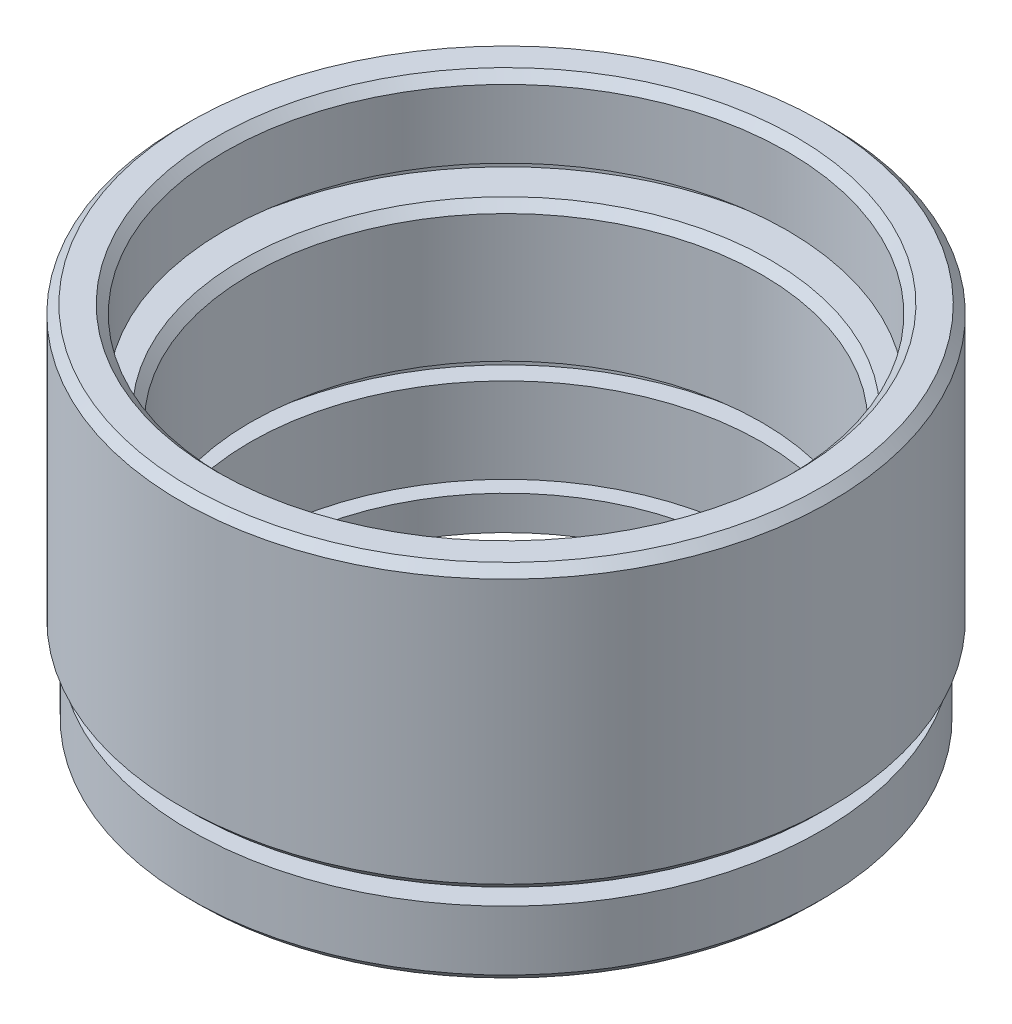
ISO-10303-21;
HEADER;
FILE_DESCRIPTION(('STEP AP214'),'2;1');
FILE_NAME('part.step','',(''),(''),'','','');
FILE_SCHEMA(('AUTOMOTIVE_DESIGN { 1 0 10303 214 1 1 1 1 }'));
ENDSEC;
DATA;
#1=APPLICATION_CONTEXT('core data for automotive mechanical design processes');
#2=APPLICATION_PROTOCOL_DEFINITION('international standard','automotive_design',2000,#1);
#3=PRODUCT_CONTEXT('',#1,'mechanical');
#4=PRODUCT('Part','Part','',(#3));
#5=PRODUCT_RELATED_PRODUCT_CATEGORY('part','',(#4));
#6=PRODUCT_DEFINITION_FORMATION('','',#4);
#7=PRODUCT_DEFINITION_CONTEXT('part definition',#1,'design');
#8=PRODUCT_DEFINITION('design','',#6,#7);
#9=PRODUCT_DEFINITION_SHAPE('','',#8);
#10=(LENGTH_UNIT() NAMED_UNIT(*) SI_UNIT(.MILLI.,.METRE.));
#11=(NAMED_UNIT(*) PLANE_ANGLE_UNIT() SI_UNIT($,.RADIAN.));
#12=(NAMED_UNIT(*) SI_UNIT($,.STERADIAN.) SOLID_ANGLE_UNIT());
#13=UNCERTAINTY_MEASURE_WITH_UNIT(LENGTH_MEASURE(1.E-05),#10,'distance_accuracy_value','');
#14=(GEOMETRIC_REPRESENTATION_CONTEXT(3) GLOBAL_UNCERTAINTY_ASSIGNED_CONTEXT((#13)) GLOBAL_UNIT_ASSIGNED_CONTEXT((#10,
#11,#12)) REPRESENTATION_CONTEXT('',''));
#15=CARTESIAN_POINT('',(0.,0.,0.));
#16=DIRECTION('',(0.,0.,1.));
#17=DIRECTION('',(1.,0.,0.));
#18=AXIS2_PLACEMENT_3D('',#15,#16,#17);
#19=CARTESIAN_POINT('',(16.5,21.5,0.));
#20=DIRECTION('',(0.,1.,0.));
#21=DIRECTION('',(0.,0.,1.));
#22=AXIS2_PLACEMENT_3D('',#19,#20,#21);
#23=PLANE('',#22);
#24=CARTESIAN_POINT('',(0.,21.5,0.));
#25=DIRECTION('',(0.,1.,0.));
#26=DIRECTION('',(0.,0.,1.));
#27=AXIS2_PLACEMENT_3D('',#24,#25,#26);
#28=CIRCLE('',#27,17.);
#29=CARTESIAN_POINT('',(0.,21.5,17.));
#30=VERTEX_POINT('',#29);
#31=EDGE_CURVE('E47',#30,#30,#28,.F.);
#32=ORIENTED_EDGE('',*,*,#31,.T.);
#33=EDGE_LOOP('',(#32));
#34=FACE_BOUND('',#33,.T.);
#35=CARTESIAN_POINT('',(0.,21.5,0.));
#36=DIRECTION('',(0.,-1.,0.));
#37=DIRECTION('',(0.,0.,-1.));
#38=AXIS2_PLACEMENT_3D('',#35,#36,#37);
#39=CIRCLE('',#38,18.55);
#40=CARTESIAN_POINT('',(0.,21.5,-18.55));
#41=VERTEX_POINT('',#40);
#42=EDGE_CURVE('E136',#41,#41,#39,.T.);
#43=ORIENTED_EDGE('',*,*,#42,.F.);
#44=EDGE_LOOP('',(#43));
#45=FACE_BOUND('',#44,.T.);
#46=ADVANCED_FACE('F39',(#34,#45),#23,.T.);
#47=CARTESIAN_POINT('',(0.,0.,0.));
#48=DIRECTION('',(0.,-1.,0.));
#49=DIRECTION('',(0.,0.,-1.));
#50=AXIS2_PLACEMENT_3D('',#47,#48,#49);
#51=CYLINDRICAL_SURFACE('',#50,16.5);
#52=CARTESIAN_POINT('',(0.,21.,0.));
#53=DIRECTION('',(0.,1.,0.));
#54=DIRECTION('',(0.,0.,1.));
#55=AXIS2_PLACEMENT_3D('',#52,#53,#54);
#56=CIRCLE('',#55,16.5);
#57=CARTESIAN_POINT('',(0.,21.,16.5));
#58=VERTEX_POINT('',#57);
#59=EDGE_CURVE('E10',#58,#58,#56,.T.);
#60=ORIENTED_EDGE('',*,*,#59,.T.);
#61=EDGE_LOOP('',(#60));
#62=FACE_BOUND('',#61,.T.);
#63=CARTESIAN_POINT('',(0.,17.,0.));
#64=DIRECTION('',(0.,-1.,0.));
#65=DIRECTION('',(0.,0.,-1.));
#66=AXIS2_PLACEMENT_3D('',#63,#64,#65);
#67=CIRCLE('',#66,16.5);
#68=CARTESIAN_POINT('',(0.,17.,-16.5));
#69=VERTEX_POINT('',#68);
#70=EDGE_CURVE('E66',#69,#69,#67,.T.);
#71=ORIENTED_EDGE('',*,*,#70,.T.);
#72=EDGE_LOOP('',(#71));
#73=FACE_BOUND('',#72,.T.);
#74=ADVANCED_FACE('F144',(#62,#73),#51,.F.);
#75=CARTESIAN_POINT('',(17.65,17.,0.));
#76=DIRECTION('',(0.,-1.,0.));
#77=DIRECTION('',(0.,0.,-1.));
#78=AXIS2_PLACEMENT_3D('',#75,#76,#77);
#79=PLANE('',#78);
#80=CARTESIAN_POINT('',(0.,17.,0.));
#81=DIRECTION('',(0.,-1.,0.));
#82=DIRECTION('',(0.,0.,-1.));
#83=AXIS2_PLACEMENT_3D('',#80,#81,#82);
#84=CIRCLE('',#83,17.65);
#85=CARTESIAN_POINT('',(0.,17.,-17.65));
#86=VERTEX_POINT('',#85);
#87=EDGE_CURVE('E69',#86,#86,#84,.T.);
#88=ORIENTED_EDGE('',*,*,#87,.T.);
#89=EDGE_LOOP('',(#88));
#90=FACE_BOUND('',#89,.T.);
#91=ORIENTED_EDGE('',*,*,#70,.F.);
#92=EDGE_LOOP('',(#91));
#93=FACE_BOUND('',#92,.T.);
#94=ADVANCED_FACE('F149',(#90,#93),#79,.T.);
#95=CARTESIAN_POINT('',(0.,0.,0.));
#96=DIRECTION('',(0.,-1.,0.));
#97=DIRECTION('',(0.,0.,-1.));
#98=AXIS2_PLACEMENT_3D('',#95,#96,#97);
#99=CYLINDRICAL_SURFACE('',#98,17.65);
#100=CARTESIAN_POINT('',(0.,16.,0.));
#101=DIRECTION('',(0.,-1.,0.));
#102=DIRECTION('',(0.,0.,-1.));
#103=AXIS2_PLACEMENT_3D('',#100,#101,#102);
#104=CIRCLE('',#103,17.65);
#105=CARTESIAN_POINT('',(0.,16.,-17.65));
#106=VERTEX_POINT('',#105);
#107=EDGE_CURVE('E73',#106,#106,#104,.T.);
#108=ORIENTED_EDGE('',*,*,#107,.T.);
#109=EDGE_LOOP('',(#108));
#110=FACE_BOUND('',#109,.T.);
#111=ORIENTED_EDGE('',*,*,#87,.F.);
#112=EDGE_LOOP('',(#111));
#113=FACE_BOUND('',#112,.T.);
#114=ADVANCED_FACE('F170',(#110,#113),#99,.F.);
#115=CARTESIAN_POINT('',(15.,16.,0.));
#116=DIRECTION('',(0.,1.,0.));
#117=DIRECTION('',(0.,0.,1.));
#118=AXIS2_PLACEMENT_3D('',#115,#116,#117);
#119=PLANE('',#118);
#120=CARTESIAN_POINT('',(0.,16.,0.));
#121=DIRECTION('',(0.,1.,0.));
#122=DIRECTION('',(0.,0.,1.));
#123=AXIS2_PLACEMENT_3D('',#120,#121,#122);
#124=CIRCLE('',#123,15.5);
#125=CARTESIAN_POINT('',(0.,16.,15.5));
#126=VERTEX_POINT('',#125);
#127=EDGE_CURVE('E61',#126,#126,#124,.F.);
#128=ORIENTED_EDGE('',*,*,#127,.T.);
#129=EDGE_LOOP('',(#128));
#130=FACE_BOUND('',#129,.T.);
#131=ORIENTED_EDGE('',*,*,#107,.F.);
#132=EDGE_LOOP('',(#131));
#133=FACE_BOUND('',#132,.T.);
#134=ADVANCED_FACE('F166',(#130,#133),#119,.T.);
#135=CARTESIAN_POINT('',(0.,0.,0.));
#136=DIRECTION('',(0.,-1.,0.));
#137=DIRECTION('',(0.,0.,-1.));
#138=AXIS2_PLACEMENT_3D('',#135,#136,#137);
#139=CYLINDRICAL_SURFACE('',#138,15.);
#140=CARTESIAN_POINT('',(0.,15.5,0.));
#141=DIRECTION('',(0.,1.,0.));
#142=DIRECTION('',(0.,0.,1.));
#143=AXIS2_PLACEMENT_3D('',#140,#141,#142);
#144=CIRCLE('',#143,15.);
#145=CARTESIAN_POINT('',(0.,15.5,15.));
#146=VERTEX_POINT('',#145);
#147=EDGE_CURVE('E54',#146,#146,#144,.T.);
#148=ORIENTED_EDGE('',*,*,#147,.T.);
#149=EDGE_LOOP('',(#148));
#150=FACE_BOUND('',#149,.T.);
#151=CARTESIAN_POINT('',(0.,8.,0.));
#152=DIRECTION('',(0.,-1.,0.));
#153=DIRECTION('',(0.,0.,-1.));
#154=AXIS2_PLACEMENT_3D('',#151,#152,#153);
#155=CIRCLE('',#154,15.);
#156=CARTESIAN_POINT('',(0.,8.,-15.));
#157=VERTEX_POINT('',#156);
#158=EDGE_CURVE('E77',#157,#157,#155,.T.);
#159=ORIENTED_EDGE('',*,*,#158,.T.);
#160=EDGE_LOOP('',(#159));
#161=FACE_BOUND('',#160,.T.);
#162=ADVANCED_FACE('F169',(#150,#161),#139,.F.);
#163=CARTESIAN_POINT('',(16.15,8.,0.));
#164=DIRECTION('',(0.,-1.,0.));
#165=DIRECTION('',(0.,0.,-1.));
#166=AXIS2_PLACEMENT_3D('',#163,#164,#165);
#167=PLANE('',#166);
#168=CARTESIAN_POINT('',(0.,8.,0.));
#169=DIRECTION('',(0.,-1.,0.));
#170=DIRECTION('',(0.,0.,-1.));
#171=AXIS2_PLACEMENT_3D('',#168,#169,#170);
#172=CIRCLE('',#171,16.15);
#173=CARTESIAN_POINT('',(0.,8.,-16.15));
#174=VERTEX_POINT('',#173);
#175=EDGE_CURVE('E81',#174,#174,#172,.T.);
#176=ORIENTED_EDGE('',*,*,#175,.T.);
#177=EDGE_LOOP('',(#176));
#178=FACE_BOUND('',#177,.T.);
#179=ORIENTED_EDGE('',*,*,#158,.F.);
#180=EDGE_LOOP('',(#179));
#181=FACE_BOUND('',#180,.T.);
#182=ADVANCED_FACE('F188',(#178,#181),#167,.T.);
#183=CARTESIAN_POINT('',(0.,0.,0.));
#184=DIRECTION('',(0.,-1.,0.));
#185=DIRECTION('',(0.,0.,-1.));
#186=AXIS2_PLACEMENT_3D('',#183,#184,#185);
#187=CYLINDRICAL_SURFACE('',#186,16.15);
#188=CARTESIAN_POINT('',(0.,7.,0.));
#189=DIRECTION('',(0.,-1.,0.));
#190=DIRECTION('',(0.,0.,-1.));
#191=AXIS2_PLACEMENT_3D('',#188,#189,#190);
#192=CIRCLE('',#191,16.15);
#193=CARTESIAN_POINT('',(0.,7.,-16.15));
#194=VERTEX_POINT('',#193);
#195=EDGE_CURVE('E85',#194,#194,#192,.T.);
#196=ORIENTED_EDGE('',*,*,#195,.T.);
#197=EDGE_LOOP('',(#196));
#198=FACE_BOUND('',#197,.T.);
#199=ORIENTED_EDGE('',*,*,#175,.F.);
#200=EDGE_LOOP('',(#199));
#201=FACE_BOUND('',#200,.T.);
#202=ADVANCED_FACE('F192',(#198,#201),#187,.F.);
#203=CARTESIAN_POINT('',(15.,7.,0.));
#204=DIRECTION('',(0.,1.,0.));
#205=DIRECTION('',(0.,0.,1.));
#206=AXIS2_PLACEMENT_3D('',#203,#204,#205);
#207=PLANE('',#206);
#208=CARTESIAN_POINT('',(0.,7.,0.));
#209=DIRECTION('',(0.,-1.,0.));
#210=DIRECTION('',(0.,0.,-1.));
#211=AXIS2_PLACEMENT_3D('',#208,#209,#210);
#212=CIRCLE('',#211,15.);
#213=CARTESIAN_POINT('',(0.,7.,-15.));
#214=VERTEX_POINT('',#213);
#215=EDGE_CURVE('E89',#214,#214,#212,.T.);
#216=ORIENTED_EDGE('',*,*,#215,.T.);
#217=EDGE_LOOP('',(#216));
#218=FACE_BOUND('',#217,.T.);
#219=ORIENTED_EDGE('',*,*,#195,.F.);
#220=EDGE_LOOP('',(#219));
#221=FACE_BOUND('',#220,.T.);
#222=ADVANCED_FACE('F196',(#218,#221),#207,.T.);
#223=CARTESIAN_POINT('',(0.,0.,0.));
#224=DIRECTION('',(0.,-1.,0.));
#225=DIRECTION('',(0.,0.,-1.));
#226=AXIS2_PLACEMENT_3D('',#223,#224,#225);
#227=CYLINDRICAL_SURFACE('',#226,15.);
#228=CARTESIAN_POINT('',(0.,2.,0.));
#229=DIRECTION('',(0.,-1.,0.));
#230=DIRECTION('',(0.,0.,-1.));
#231=AXIS2_PLACEMENT_3D('',#228,#229,#230);
#232=CIRCLE('',#231,15.);
#233=CARTESIAN_POINT('',(0.,2.,-15.));
#234=VERTEX_POINT('',#233);
#235=EDGE_CURVE('E93',#234,#234,#232,.T.);
#236=ORIENTED_EDGE('',*,*,#235,.T.);
#237=EDGE_LOOP('',(#236));
#238=FACE_BOUND('',#237,.T.);
#239=ORIENTED_EDGE('',*,*,#215,.F.);
#240=EDGE_LOOP('',(#239));
#241=FACE_BOUND('',#240,.T.);
#242=ADVANCED_FACE('F200',(#238,#241),#227,.F.);
#243=CARTESIAN_POINT('',(14.,2.,0.));
#244=DIRECTION('',(0.,1.,0.));
#245=DIRECTION('',(0.,0.,1.));
#246=AXIS2_PLACEMENT_3D('',#243,#244,#245);
#247=PLANE('',#246);
#248=CARTESIAN_POINT('',(0.,2.,0.));
#249=DIRECTION('',(0.,-1.,0.));
#250=DIRECTION('',(0.,0.,-1.));
#251=AXIS2_PLACEMENT_3D('',#248,#249,#250);
#252=CIRCLE('',#251,14.);
#253=CARTESIAN_POINT('',(0.,2.,-14.));
#254=VERTEX_POINT('',#253);
#255=EDGE_CURVE('E97',#254,#254,#252,.T.);
#256=ORIENTED_EDGE('',*,*,#255,.T.);
#257=EDGE_LOOP('',(#256));
#258=FACE_BOUND('',#257,.T.);
#259=ORIENTED_EDGE('',*,*,#235,.F.);
#260=EDGE_LOOP('',(#259));
#261=FACE_BOUND('',#260,.T.);
#262=ADVANCED_FACE('F204',(#258,#261),#247,.T.);
#263=CARTESIAN_POINT('',(0.,0.,0.));
#264=DIRECTION('',(0.,-1.,0.));
#265=DIRECTION('',(0.,0.,-1.));
#266=AXIS2_PLACEMENT_3D('',#263,#264,#265);
#267=CYLINDRICAL_SURFACE('',#266,14.);
#268=CARTESIAN_POINT('',(0.,0.,0.));
#269=DIRECTION('',(0.,-1.,0.));
#270=DIRECTION('',(0.,0.,-1.));
#271=AXIS2_PLACEMENT_3D('',#268,#269,#270);
#272=CIRCLE('',#271,14.);
#273=CARTESIAN_POINT('',(0.,0.,-14.));
#274=VERTEX_POINT('',#273);
#275=EDGE_CURVE('E101',#274,#274,#272,.T.);
#276=ORIENTED_EDGE('',*,*,#275,.T.);
#277=EDGE_LOOP('',(#276));
#278=FACE_BOUND('',#277,.T.);
#279=ORIENTED_EDGE('',*,*,#255,.F.);
#280=EDGE_LOOP('',(#279));
#281=FACE_BOUND('',#280,.T.);
#282=ADVANCED_FACE('F208',(#278,#281),#267,.F.);
#283=CARTESIAN_POINT('',(14.,0.,0.));
#284=DIRECTION('',(0.,-1.,0.));
#285=DIRECTION('',(0.,0.,-1.));
#286=AXIS2_PLACEMENT_3D('',#283,#284,#285);
#287=PLANE('',#286);
#288=CARTESIAN_POINT('',(0.,0.,0.));
#289=DIRECTION('',(0.,-1.,0.));
#290=DIRECTION('',(0.,0.,-1.));
#291=AXIS2_PLACEMENT_3D('',#288,#289,#290);
#292=CIRCLE('',#291,18.);
#293=CARTESIAN_POINT('',(0.,0.,-18.));
#294=VERTEX_POINT('',#293);
#295=EDGE_CURVE('E105',#294,#294,#292,.T.);
#296=ORIENTED_EDGE('',*,*,#295,.T.);
#297=EDGE_LOOP('',(#296));
#298=FACE_BOUND('',#297,.T.);
#299=ORIENTED_EDGE('',*,*,#275,.F.);
#300=EDGE_LOOP('',(#299));
#301=FACE_BOUND('',#300,.T.);
#302=ADVANCED_FACE('F212',(#298,#301),#287,.T.);
#303=CARTESIAN_POINT('',(0.,0.,0.));
#304=DIRECTION('',(0.,1.,0.));
#305=DIRECTION('',(0.,0.,1.));
#306=AXIS2_PLACEMENT_3D('',#303,#304,#305);
#307=CONICAL_SURFACE('',#306,18.,0.785398163397451);
#308=CARTESIAN_POINT('',(0.,0.499999999999998,0.));
#309=DIRECTION('',(0.,-1.,0.));
#310=DIRECTION('',(0.,0.,-1.));
#311=AXIS2_PLACEMENT_3D('',#308,#309,#310);
#312=CIRCLE('',#311,18.5);
#313=CARTESIAN_POINT('',(0.,0.499999999999998,-18.5));
#314=VERTEX_POINT('',#313);
#315=EDGE_CURVE('E109',#314,#314,#312,.T.);
#316=ORIENTED_EDGE('',*,*,#315,.T.);
#317=EDGE_LOOP('',(#316));
#318=FACE_BOUND('',#317,.T.);
#319=ORIENTED_EDGE('',*,*,#295,.F.);
#320=EDGE_LOOP('',(#319));
#321=FACE_BOUND('',#320,.T.);
#322=ADVANCED_FACE('F216',(#318,#321),#307,.T.);
#323=CARTESIAN_POINT('',(0.,0.,0.));
#324=DIRECTION('',(0.,-1.,0.));
#325=DIRECTION('',(0.,0.,-1.));
#326=AXIS2_PLACEMENT_3D('',#323,#324,#325);
#327=CYLINDRICAL_SURFACE('',#326,18.5);
#328=CARTESIAN_POINT('',(0.,4.,0.));
#329=DIRECTION('',(0.,-1.,0.));
#330=DIRECTION('',(0.,0.,-1.));
#331=AXIS2_PLACEMENT_3D('',#328,#329,#330);
#332=CIRCLE('',#331,18.5);
#333=CARTESIAN_POINT('',(0.,4.,-18.5));
#334=VERTEX_POINT('',#333);
#335=EDGE_CURVE('E113',#334,#334,#332,.T.);
#336=ORIENTED_EDGE('',*,*,#335,.T.);
#337=EDGE_LOOP('',(#336));
#338=FACE_BOUND('',#337,.T.);
#339=ORIENTED_EDGE('',*,*,#315,.F.);
#340=EDGE_LOOP('',(#339));
#341=FACE_BOUND('',#340,.T.);
#342=ADVANCED_FACE('F220',(#338,#341),#327,.T.);
#343=CARTESIAN_POINT('',(18.5,4.,0.));
#344=DIRECTION('',(0.,1.,0.));
#345=DIRECTION('',(0.,0.,1.));
#346=AXIS2_PLACEMENT_3D('',#343,#344,#345);
#347=PLANE('',#346);
#348=CARTESIAN_POINT('',(0.,4.,0.));
#349=DIRECTION('',(0.,-1.,0.));
#350=DIRECTION('',(0.,0.,-1.));
#351=AXIS2_PLACEMENT_3D('',#348,#349,#350);
#352=CIRCLE('',#351,17.);
#353=CARTESIAN_POINT('',(0.,4.,-17.));
#354=VERTEX_POINT('',#353);
#355=EDGE_CURVE('E117',#354,#354,#352,.T.);
#356=ORIENTED_EDGE('',*,*,#355,.T.);
#357=EDGE_LOOP('',(#356));
#358=FACE_BOUND('',#357,.T.);
#359=ORIENTED_EDGE('',*,*,#335,.F.);
#360=EDGE_LOOP('',(#359));
#361=FACE_BOUND('',#360,.T.);
#362=ADVANCED_FACE('F224',(#358,#361),#347,.T.);
#363=CARTESIAN_POINT('',(0.,0.,0.));
#364=DIRECTION('',(0.,-1.,0.));
#365=DIRECTION('',(0.,0.,-1.));
#366=AXIS2_PLACEMENT_3D('',#363,#364,#365);
#367=CYLINDRICAL_SURFACE('',#366,17.);
#368=CARTESIAN_POINT('',(0.,5.,0.));
#369=DIRECTION('',(0.,-1.,0.));
#370=DIRECTION('',(0.,0.,-1.));
#371=AXIS2_PLACEMENT_3D('',#368,#369,#370);
#372=CIRCLE('',#371,17.);
#373=CARTESIAN_POINT('',(0.,5.,-17.));
#374=VERTEX_POINT('',#373);
#375=EDGE_CURVE('E121',#374,#374,#372,.T.);
#376=ORIENTED_EDGE('',*,*,#375,.T.);
#377=EDGE_LOOP('',(#376));
#378=FACE_BOUND('',#377,.T.);
#379=ORIENTED_EDGE('',*,*,#355,.F.);
#380=EDGE_LOOP('',(#379));
#381=FACE_BOUND('',#380,.T.);
#382=ADVANCED_FACE('F228',(#378,#381),#367,.T.);
#383=CARTESIAN_POINT('',(17.,5.,0.));
#384=DIRECTION('',(0.,-1.,0.));
#385=DIRECTION('',(0.,0.,-1.));
#386=AXIS2_PLACEMENT_3D('',#383,#384,#385);
#387=PLANE('',#386);
#388=CARTESIAN_POINT('',(0.,5.,0.));
#389=DIRECTION('',(0.,-1.,0.));
#390=DIRECTION('',(0.,0.,-1.));
#391=AXIS2_PLACEMENT_3D('',#388,#389,#390);
#392=CIRCLE('',#391,18.55);
#393=CARTESIAN_POINT('',(0.,5.,-18.55));
#394=VERTEX_POINT('',#393);
#395=EDGE_CURVE('E125',#394,#394,#392,.T.);
#396=ORIENTED_EDGE('',*,*,#395,.T.);
#397=EDGE_LOOP('',(#396));
#398=FACE_BOUND('',#397,.T.);
#399=ORIENTED_EDGE('',*,*,#375,.F.);
#400=EDGE_LOOP('',(#399));
#401=FACE_BOUND('',#400,.T.);
#402=ADVANCED_FACE('F232',(#398,#401),#387,.T.);
#403=CARTESIAN_POINT('',(0.,5.,0.));
#404=DIRECTION('',(0.,1.,0.));
#405=DIRECTION('',(0.,0.,1.));
#406=AXIS2_PLACEMENT_3D('',#403,#404,#405);
#407=CONICAL_SURFACE('',#406,18.55,0.785398163397451);
#408=CARTESIAN_POINT('',(0.,5.5,0.));
#409=DIRECTION('',(0.,-1.,0.));
#410=DIRECTION('',(0.,0.,-1.));
#411=AXIS2_PLACEMENT_3D('',#408,#409,#410);
#412=CIRCLE('',#411,19.05);
#413=CARTESIAN_POINT('',(0.,5.5,-19.05));
#414=VERTEX_POINT('',#413);
#415=EDGE_CURVE('E128',#414,#414,#412,.T.);
#416=ORIENTED_EDGE('',*,*,#415,.T.);
#417=EDGE_LOOP('',(#416));
#418=FACE_BOUND('',#417,.T.);
#419=ORIENTED_EDGE('',*,*,#395,.F.);
#420=EDGE_LOOP('',(#419));
#421=FACE_BOUND('',#420,.T.);
#422=ADVANCED_FACE('F236',(#418,#421),#407,.T.);
#423=CARTESIAN_POINT('',(0.,0.,0.));
#424=DIRECTION('',(0.,-1.,0.));
#425=DIRECTION('',(0.,0.,-1.));
#426=AXIS2_PLACEMENT_3D('',#423,#424,#425);
#427=CYLINDRICAL_SURFACE('',#426,19.05);
#428=CARTESIAN_POINT('',(0.,21.,0.));
#429=DIRECTION('',(0.,-1.,0.));
#430=DIRECTION('',(0.,0.,-1.));
#431=AXIS2_PLACEMENT_3D('',#428,#429,#430);
#432=CIRCLE('',#431,19.05);
#433=CARTESIAN_POINT('',(0.,21.,-19.05));
#434=VERTEX_POINT('',#433);
#435=EDGE_CURVE('E132',#434,#434,#432,.T.);
#436=ORIENTED_EDGE('',*,*,#435,.T.);
#437=EDGE_LOOP('',(#436));
#438=FACE_BOUND('',#437,.T.);
#439=ORIENTED_EDGE('',*,*,#415,.F.);
#440=EDGE_LOOP('',(#439));
#441=FACE_BOUND('',#440,.T.);
#442=ADVANCED_FACE('F160',(#438,#441),#427,.T.);
#443=CARTESIAN_POINT('',(0.,21.,0.));
#444=DIRECTION('',(0.,-1.,0.));
#445=DIRECTION('',(0.,0.,-1.));
#446=AXIS2_PLACEMENT_3D('',#443,#444,#445);
#447=CONICAL_SURFACE('',#446,19.05,0.785398163397445);
#448=ORIENTED_EDGE('',*,*,#42,.T.);
#449=EDGE_LOOP('',(#448));
#450=FACE_BOUND('',#449,.T.);
#451=ORIENTED_EDGE('',*,*,#435,.F.);
#452=EDGE_LOOP('',(#451));
#453=FACE_BOUND('',#452,.T.);
#454=ADVANCED_FACE('F140',(#450,#453),#447,.T.);
#455=CARTESIAN_POINT('',(0.,16.,0.));
#456=DIRECTION('',(0.,1.,0.));
#457=DIRECTION('',(0.,0.,1.));
#458=AXIS2_PLACEMENT_3D('',#455,#456,#457);
#459=CONICAL_SURFACE('',#458,15.5,0.785398163397443);
#460=ORIENTED_EDGE('',*,*,#147,.F.);
#461=EDGE_LOOP('',(#460));
#462=FACE_BOUND('',#461,.T.);
#463=ORIENTED_EDGE('',*,*,#127,.F.);
#464=EDGE_LOOP('',(#463));
#465=FACE_BOUND('',#464,.T.);
#466=ADVANCED_FACE('F152',(#462,#465),#459,.F.);
#467=CARTESIAN_POINT('',(0.,21.5,0.));
#468=DIRECTION('',(0.,1.,0.));
#469=DIRECTION('',(0.,0.,1.));
#470=AXIS2_PLACEMENT_3D('',#467,#468,#469);
#471=CONICAL_SURFACE('',#470,17.,0.785398163397445);
#472=ORIENTED_EDGE('',*,*,#59,.F.);
#473=EDGE_LOOP('',(#472));
#474=FACE_BOUND('',#473,.T.);
#475=ORIENTED_EDGE('',*,*,#31,.F.);
#476=EDGE_LOOP('',(#475));
#477=FACE_BOUND('',#476,.T.);
#478=ADVANCED_FACE('F41',(#474,#477),#471,.F.);
#479=CLOSED_SHELL('',(#46,#74,#94,#114,#134,#162,#182,#202,#222,#242,#262,#282,#302,#322,#342,
#362,#382,#402,#422,#442,#454,#466,#478));
#480=MANIFOLD_SOLID_BREP('B2',#479);
#481=ADVANCED_BREP_SHAPE_REPRESENTATION('',(#18,#480),#14);
#482=SHAPE_DEFINITION_REPRESENTATION(#9,#481);
ENDSEC;
END-ISO-10303-21;
